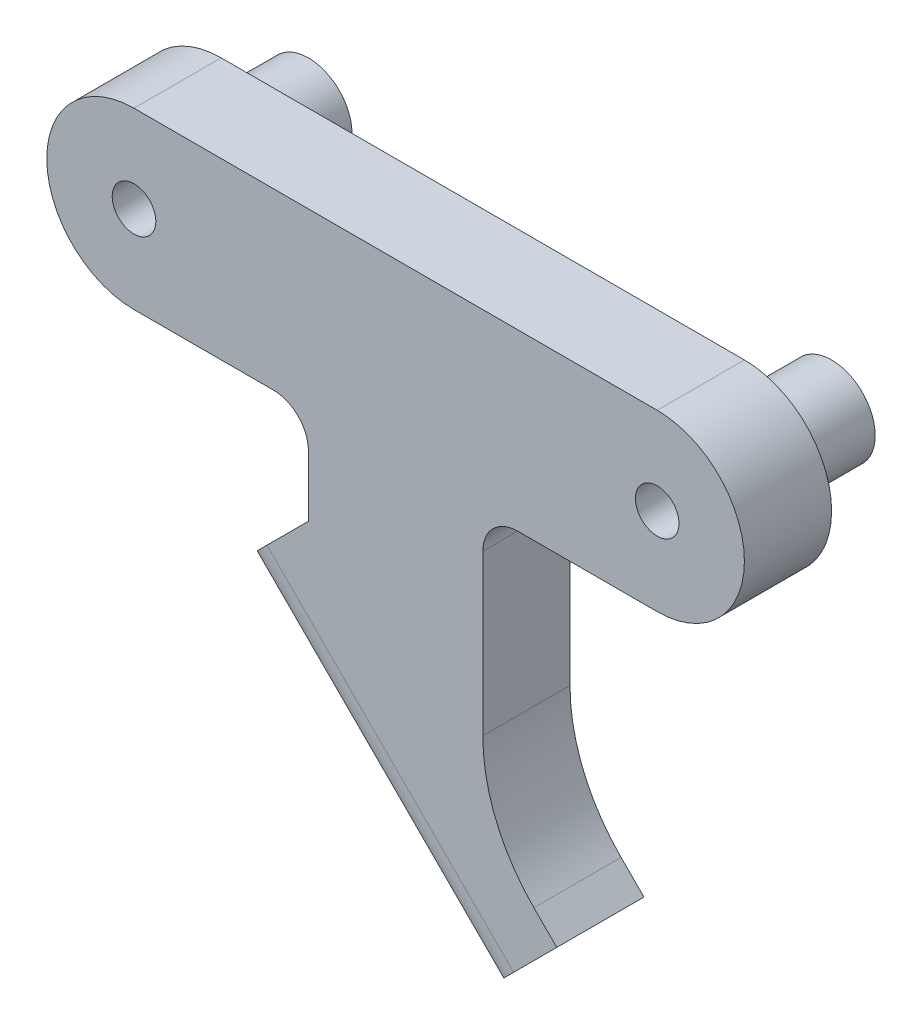
ISO-10303-21;
HEADER;
FILE_DESCRIPTION(('STEP AP214'),'2;1');
FILE_NAME('part.step','',(''),(''),'','','');
FILE_SCHEMA(('AUTOMOTIVE_DESIGN { 1 0 10303 214 1 1 1 1 }'));
ENDSEC;
DATA;
#1=APPLICATION_CONTEXT('core data for automotive mechanical design processes');
#2=APPLICATION_PROTOCOL_DEFINITION('international standard','automotive_design',2000,#1);
#3=PRODUCT_CONTEXT('',#1,'mechanical');
#4=PRODUCT('Part','Part','',(#3));
#5=PRODUCT_RELATED_PRODUCT_CATEGORY('part','',(#4));
#6=PRODUCT_DEFINITION_FORMATION('','',#4);
#7=PRODUCT_DEFINITION_CONTEXT('part definition',#1,'design');
#8=PRODUCT_DEFINITION('design','',#6,#7);
#9=PRODUCT_DEFINITION_SHAPE('','',#8);
#10=(LENGTH_UNIT() NAMED_UNIT(*) SI_UNIT(.MILLI.,.METRE.));
#11=(NAMED_UNIT(*) PLANE_ANGLE_UNIT() SI_UNIT($,.RADIAN.));
#12=(NAMED_UNIT(*) SI_UNIT($,.STERADIAN.) SOLID_ANGLE_UNIT());
#13=UNCERTAINTY_MEASURE_WITH_UNIT(LENGTH_MEASURE(1.E-05),#10,'distance_accuracy_value','');
#14=(GEOMETRIC_REPRESENTATION_CONTEXT(3) GLOBAL_UNCERTAINTY_ASSIGNED_CONTEXT((#13)) GLOBAL_UNIT_ASSIGNED_CONTEXT((#10,
#11,#12)) REPRESENTATION_CONTEXT('',''));
#15=CARTESIAN_POINT('',(0.,0.,0.));
#16=DIRECTION('',(0.,0.,1.));
#17=DIRECTION('',(1.,0.,0.));
#18=AXIS2_PLACEMENT_3D('',#15,#16,#17);
#19=CARTESIAN_POINT('',(-3.20799180327869,-5.,5.));
#20=DIRECTION('',(1.,0.,0.));
#21=DIRECTION('',(0.,1.,0.));
#22=AXIS2_PLACEMENT_3D('',#19,#20,#21);
#23=PLANE('',#22);
#24=DIRECTION('',(0.,-1.,0.));
#25=VECTOR('',#24,1.);
#26=CARTESIAN_POINT('',(-3.20799180327869,-5.,5.));
#27=LINE('',#26,#25);
#28=CARTESIAN_POINT('',(-3.20799180327869,-7.,5.));
#29=VERTEX_POINT('',#28);
#30=CARTESIAN_POINT('',(-3.20799180327869,-10.5098308312046,5.));
#31=VERTEX_POINT('',#30);
#32=EDGE_CURVE('E198',#29,#31,#27,.T.);
#33=ORIENTED_EDGE('',*,*,#32,.F.);
#34=DIRECTION('',(0.,0.,-1.));
#35=VECTOR('',#34,1.);
#36=CARTESIAN_POINT('',(-3.20799180327869,-7.,0.));
#37=LINE('',#36,#35);
#38=CARTESIAN_POINT('',(-3.20799180327869,-7.,0.));
#39=VERTEX_POINT('',#38);
#40=EDGE_CURVE('E253',#29,#39,#37,.T.);
#41=ORIENTED_EDGE('',*,*,#40,.T.);
#42=DIRECTION('',(0.,-1.,0.));
#43=VECTOR('',#42,1.);
#44=CARTESIAN_POINT('',(-3.20799180327869,-5.,0.));
#45=LINE('',#44,#43);
#46=CARTESIAN_POINT('',(-3.20799180327869,-10.5098308312046,0.));
#47=VERTEX_POINT('',#46);
#48=EDGE_CURVE('E215',#39,#47,#45,.T.);
#49=ORIENTED_EDGE('',*,*,#48,.T.);
#50=DIRECTION('',(0.,0.,-1.));
#51=VECTOR('',#50,1.);
#52=CARTESIAN_POINT('',(-3.20799180327869,-10.5098308312046,5.));
#53=LINE('',#52,#51);
#54=EDGE_CURVE('E159',#31,#47,#53,.T.);
#55=ORIENTED_EDGE('',*,*,#54,.F.);
#56=EDGE_LOOP('',(#33,#41,#49,#55));
#57=FACE_BOUND('',#56,.T.);
#58=ADVANCED_FACE('F48',(#57),#23,.F.);
#59=CARTESIAN_POINT('',(6.79200819672131,-5.,5.));
#60=DIRECTION('',(1.,0.,0.));
#61=DIRECTION('',(0.,1.,0.));
#62=AXIS2_PLACEMENT_3D('',#59,#60,#61);
#63=PLANE('',#62);
#64=DIRECTION('',(0.,1.,0.));
#65=VECTOR('',#64,1.);
#66=CARTESIAN_POINT('',(6.79200819672131,-28.7941020786666,5.));
#67=LINE('',#66,#65);
#68=CARTESIAN_POINT('',(6.79200819672131,-16.1666850806971,5.));
#69=VERTEX_POINT('',#68);
#70=CARTESIAN_POINT('',(6.79200819672131,-7.,5.));
#71=VERTEX_POINT('',#70);
#72=EDGE_CURVE('E200',#69,#71,#67,.T.);
#73=ORIENTED_EDGE('',*,*,#72,.F.);
#74=DIRECTION('',(0.,0.,-1.));
#75=VECTOR('',#74,1.);
#76=CARTESIAN_POINT('',(6.79200819672131,-16.1666850806971,5.));
#77=LINE('',#76,#75);
#78=CARTESIAN_POINT('',(6.79200819672131,-16.1666850806971,0.));
#79=VERTEX_POINT('',#78);
#80=EDGE_CURVE('E277',#69,#79,#77,.T.);
#81=ORIENTED_EDGE('',*,*,#80,.T.);
#82=DIRECTION('',(0.,-1.,0.));
#83=VECTOR('',#82,1.);
#84=CARTESIAN_POINT('',(6.79200819672131,-5.,0.));
#85=LINE('',#84,#83);
#86=CARTESIAN_POINT('',(6.79200819672131,-7.,0.));
#87=VERTEX_POINT('',#86);
#88=EDGE_CURVE('E217',#87,#79,#85,.T.);
#89=ORIENTED_EDGE('',*,*,#88,.F.);
#90=DIRECTION('',(0.,0.,-1.));
#91=VECTOR('',#90,1.);
#92=CARTESIAN_POINT('',(6.79200819672131,-7.,5.));
#93=LINE('',#92,#91);
#94=EDGE_CURVE('E266',#87,#71,#93,.F.);
#95=ORIENTED_EDGE('',*,*,#94,.T.);
#96=EDGE_LOOP('',(#73,#81,#89,#95));
#97=FACE_BOUND('',#96,.T.);
#98=ADVANCED_FACE('F284',(#97),#63,.T.);
#99=CARTESIAN_POINT('',(-13.2079918032787,0.,5.));
#100=DIRECTION('',(0.,0.,-1.));
#101=DIRECTION('',(-1.,0.,0.));
#102=AXIS2_PLACEMENT_3D('',#99,#100,#101);
#103=CYLINDRICAL_SURFACE('',#102,5.);
#104=CARTESIAN_POINT('',(-13.2079918032787,0.,0.));
#105=DIRECTION('',(0.,0.,1.));
#106=DIRECTION('',(1.,0.,0.));
#107=AXIS2_PLACEMENT_3D('',#104,#105,#106);
#108=CIRCLE('',#107,5.);
#109=CARTESIAN_POINT('',(-13.2079918032787,5.,0.));
#110=VERTEX_POINT('',#109);
#111=CARTESIAN_POINT('',(-13.2079918032787,-5.,0.));
#112=VERTEX_POINT('',#111);
#113=EDGE_CURVE('E190',#110,#112,#108,.T.);
#114=ORIENTED_EDGE('',*,*,#113,.T.);
#115=DIRECTION('',(0.,0.,-1.));
#116=VECTOR('',#115,1.);
#117=CARTESIAN_POINT('',(-13.2079918032787,-5.,5.));
#118=LINE('',#117,#116);
#119=CARTESIAN_POINT('',(-13.2079918032787,-5.,5.));
#120=VERTEX_POINT('',#119);
#121=EDGE_CURVE('E232',#120,#112,#118,.T.);
#122=ORIENTED_EDGE('',*,*,#121,.F.);
#123=CARTESIAN_POINT('',(-13.2079918032787,0.,5.));
#124=DIRECTION('',(0.,0.,1.));
#125=DIRECTION('',(1.,0.,0.));
#126=AXIS2_PLACEMENT_3D('',#123,#124,#125);
#127=CIRCLE('',#126,5.);
#128=CARTESIAN_POINT('',(-13.2079918032787,5.,5.));
#129=VERTEX_POINT('',#128);
#130=EDGE_CURVE('E191',#129,#120,#127,.T.);
#131=ORIENTED_EDGE('',*,*,#130,.F.);
#132=DIRECTION('',(0.,0.,-1.));
#133=VECTOR('',#132,1.);
#134=CARTESIAN_POINT('',(-13.2079918032787,5.,5.));
#135=LINE('',#134,#133);
#136=EDGE_CURVE('E209',#129,#110,#135,.T.);
#137=ORIENTED_EDGE('',*,*,#136,.T.);
#138=EDGE_LOOP('',(#114,#122,#131,#137));
#139=FACE_BOUND('',#138,.T.);
#140=ADVANCED_FACE('F313',(#139),#103,.T.);
#141=CARTESIAN_POINT('',(-13.2079918032787,-5.,5.));
#142=DIRECTION('',(0.,1.,0.));
#143=DIRECTION('',(0.,0.,1.));
#144=AXIS2_PLACEMENT_3D('',#141,#142,#143);
#145=PLANE('',#144);
#146=DIRECTION('',(1.,0.,0.));
#147=VECTOR('',#146,1.);
#148=CARTESIAN_POINT('',(-13.2079918032787,-5.,0.));
#149=LINE('',#148,#147);
#150=CARTESIAN_POINT('',(-5.20799180327869,-5.,0.));
#151=VERTEX_POINT('',#150);
#152=EDGE_CURVE('E212',#112,#151,#149,.T.);
#153=ORIENTED_EDGE('',*,*,#152,.T.);
#154=DIRECTION('',(0.,0.,-1.));
#155=VECTOR('',#154,1.);
#156=CARTESIAN_POINT('',(-5.20799180327869,-5.,5.));
#157=LINE('',#156,#155);
#158=CARTESIAN_POINT('',(-5.20799180327869,-5.,5.));
#159=VERTEX_POINT('',#158);
#160=EDGE_CURVE('E261',#151,#159,#157,.F.);
#161=ORIENTED_EDGE('',*,*,#160,.T.);
#162=DIRECTION('',(1.,0.,0.));
#163=VECTOR('',#162,1.);
#164=CARTESIAN_POINT('',(-13.2079918032787,-5.,5.));
#165=LINE('',#164,#163);
#166=EDGE_CURVE('E194',#120,#159,#165,.T.);
#167=ORIENTED_EDGE('',*,*,#166,.F.);
#168=ORIENTED_EDGE('',*,*,#121,.T.);
#169=EDGE_LOOP('',(#153,#161,#167,#168));
#170=FACE_BOUND('',#169,.T.);
#171=ADVANCED_FACE('F318',(#170),#145,.F.);
#172=CARTESIAN_POINT('',(6.79200819672131,-5.,5.));
#173=DIRECTION('',(0.,1.,0.));
#174=DIRECTION('',(-1.,0.,0.));
#175=AXIS2_PLACEMENT_3D('',#172,#173,#174);
#176=PLANE('',#175);
#177=DIRECTION('',(1.,0.,0.));
#178=VECTOR('',#177,1.);
#179=CARTESIAN_POINT('',(6.79200819672131,-5.,5.));
#180=LINE('',#179,#178);
#181=CARTESIAN_POINT('',(8.79200819672131,-5.,5.));
#182=VERTEX_POINT('',#181);
#183=CARTESIAN_POINT('',(16.7920081967213,-5.,5.));
#184=VERTEX_POINT('',#183);
#185=EDGE_CURVE('E202',#182,#184,#180,.T.);
#186=ORIENTED_EDGE('',*,*,#185,.F.);
#187=DIRECTION('',(0.,0.,-1.));
#188=VECTOR('',#187,1.);
#189=CARTESIAN_POINT('',(8.79200819672131,-5.,5.));
#190=LINE('',#189,#188);
#191=CARTESIAN_POINT('',(8.79200819672131,-5.,0.));
#192=VERTEX_POINT('',#191);
#193=EDGE_CURVE('E263',#182,#192,#190,.T.);
#194=ORIENTED_EDGE('',*,*,#193,.T.);
#195=DIRECTION('',(1.,0.,0.));
#196=VECTOR('',#195,1.);
#197=CARTESIAN_POINT('',(6.79200819672131,-5.,0.));
#198=LINE('',#197,#196);
#199=CARTESIAN_POINT('',(16.7920081967213,-5.,0.));
#200=VERTEX_POINT('',#199);
#201=EDGE_CURVE('E219',#192,#200,#198,.T.);
#202=ORIENTED_EDGE('',*,*,#201,.T.);
#203=DIRECTION('',(0.,0.,-1.));
#204=VECTOR('',#203,1.);
#205=CARTESIAN_POINT('',(16.7920081967213,-5.,5.));
#206=LINE('',#205,#204);
#207=EDGE_CURVE('E229',#184,#200,#206,.T.);
#208=ORIENTED_EDGE('',*,*,#207,.F.);
#209=EDGE_LOOP('',(#186,#194,#202,#208));
#210=FACE_BOUND('',#209,.T.);
#211=ADVANCED_FACE('F297',(#210),#176,.F.);
#212=CARTESIAN_POINT('',(16.7920081967213,0.,5.));
#213=DIRECTION('',(0.,0.,-1.));
#214=DIRECTION('',(-1.,0.,0.));
#215=AXIS2_PLACEMENT_3D('',#212,#213,#214);
#216=CYLINDRICAL_SURFACE('',#215,5.);
#217=CARTESIAN_POINT('',(16.7920081967213,0.,0.));
#218=DIRECTION('',(0.,0.,1.));
#219=DIRECTION('',(1.,0.,0.));
#220=AXIS2_PLACEMENT_3D('',#217,#218,#219);
#221=CIRCLE('',#220,5.);
#222=CARTESIAN_POINT('',(16.7920081967213,5.,0.));
#223=VERTEX_POINT('',#222);
#224=EDGE_CURVE('E221',#200,#223,#221,.T.);
#225=ORIENTED_EDGE('',*,*,#224,.T.);
#226=DIRECTION('',(0.,0.,-1.));
#227=VECTOR('',#226,1.);
#228=CARTESIAN_POINT('',(16.7920081967213,5.,5.));
#229=LINE('',#228,#227);
#230=CARTESIAN_POINT('',(16.7920081967213,5.,5.));
#231=VERTEX_POINT('',#230);
#232=EDGE_CURVE('E227',#231,#223,#229,.T.);
#233=ORIENTED_EDGE('',*,*,#232,.F.);
#234=CARTESIAN_POINT('',(16.7920081967213,0.,5.));
#235=DIRECTION('',(0.,0.,1.));
#236=DIRECTION('',(1.,0.,0.));
#237=AXIS2_PLACEMENT_3D('',#234,#235,#236);
#238=CIRCLE('',#237,5.);
#239=EDGE_CURVE('E204',#184,#231,#238,.T.);
#240=ORIENTED_EDGE('',*,*,#239,.F.);
#241=ORIENTED_EDGE('',*,*,#207,.T.);
#242=EDGE_LOOP('',(#225,#233,#240,#241));
#243=FACE_BOUND('',#242,.T.);
#244=ADVANCED_FACE('F415',(#243),#216,.T.);
#245=CARTESIAN_POINT('',(-13.2079918032787,5.,5.));
#246=DIRECTION('',(0.,1.,0.));
#247=DIRECTION('',(0.,0.,1.));
#248=AXIS2_PLACEMENT_3D('',#245,#246,#247);
#249=PLANE('',#248);
#250=DIRECTION('',(1.,0.,0.));
#251=VECTOR('',#250,1.);
#252=CARTESIAN_POINT('',(-13.2079918032787,5.,0.));
#253=LINE('',#252,#251);
#254=EDGE_CURVE('E195',#110,#223,#253,.T.);
#255=ORIENTED_EDGE('',*,*,#254,.F.);
#256=ORIENTED_EDGE('',*,*,#136,.F.);
#257=DIRECTION('',(1.,0.,0.));
#258=VECTOR('',#257,1.);
#259=CARTESIAN_POINT('',(-13.2079918032787,5.,5.));
#260=LINE('',#259,#258);
#261=EDGE_CURVE('E206',#129,#231,#260,.T.);
#262=ORIENTED_EDGE('',*,*,#261,.T.);
#263=ORIENTED_EDGE('',*,*,#232,.T.);
#264=EDGE_LOOP('',(#255,#256,#262,#263));
#265=FACE_BOUND('',#264,.T.);
#266=ADVANCED_FACE('F411',(#265),#249,.T.);
#267=CARTESIAN_POINT('',(-13.2079918032787,0.,5.));
#268=DIRECTION('',(0.,0.,1.));
#269=DIRECTION('',(1.,0.,0.));
#270=AXIS2_PLACEMENT_3D('',#267,#268,#269);
#271=PLANE('',#270);
#272=CARTESIAN_POINT('',(16.7920081967213,0.,5.));
#273=DIRECTION('',(0.,0.,-1.));
#274=DIRECTION('',(-1.,0.,0.));
#275=AXIS2_PLACEMENT_3D('',#272,#273,#274);
#276=CIRCLE('',#275,1.25);
#277=CARTESIAN_POINT('',(15.5420081967213,0.,5.));
#278=VERTEX_POINT('',#277);
#279=EDGE_CURVE('E258',#278,#278,#276,.T.);
#280=ORIENTED_EDGE('',*,*,#279,.T.);
#281=EDGE_LOOP('',(#280));
#282=FACE_BOUND('',#281,.T.);
#283=CARTESIAN_POINT('',(-13.2079918032787,0.,5.));
#284=DIRECTION('',(0.,0.,-1.));
#285=DIRECTION('',(-1.,0.,0.));
#286=AXIS2_PLACEMENT_3D('',#283,#284,#285);
#287=CIRCLE('',#286,1.25);
#288=CARTESIAN_POINT('',(-14.4579918032787,0.,5.));
#289=VERTEX_POINT('',#288);
#290=EDGE_CURVE('E368',#289,#289,#287,.T.);
#291=ORIENTED_EDGE('',*,*,#290,.T.);
#292=EDGE_LOOP('',(#291));
#293=FACE_BOUND('',#292,.T.);
#294=DIRECTION('',(0.707106781186539,0.707106781186556,0.));
#295=VECTOR('',#294,1.);
#296=CARTESIAN_POINT('',(-7.35012742700981,-14.6519664549358,5.));
#297=LINE('',#296,#295);
#298=CARTESIAN_POINT('',(-5.58236047404346,-12.8841995019694,5.));
#299=VERTEX_POINT('',#298);
#300=EDGE_CURVE('E177',#299,#31,#297,.T.);
#301=ORIENTED_EDGE('',*,*,#300,.F.);
#302=DIRECTION('',(0.707106781186556,-0.707106781186539,0.));
#303=VECTOR('',#302,1.);
#304=CARTESIAN_POINT('',(8.55977514968766,-27.0263351257002,5.));
#305=LINE('',#304,#303);
#306=CARTESIAN_POINT('',(8.55977514968767,-27.0263351257002,5.));
#307=VERTEX_POINT('',#306);
#308=EDGE_CURVE('E167',#299,#307,#305,.T.);
#309=ORIENTED_EDGE('',*,*,#308,.T.);
#310=DIRECTION('',(0.707106781186539,0.707106781186556,0.));
#311=VECTOR('',#310,1.);
#312=CARTESIAN_POINT('',(6.79200819672131,-28.7941020786666,5.));
#313=LINE('',#312,#311);
#314=CARTESIAN_POINT('',(11.0346488838405,-24.5514613915472,5.));
#315=VERTEX_POINT('',#314);
#316=EDGE_CURVE('E163',#307,#315,#313,.T.);
#317=ORIENTED_EDGE('',*,*,#316,.T.);
#318=DIRECTION('',(0.707106781186556,-0.707106781186539,0.));
#319=VECTOR('',#318,1.);
#320=CARTESIAN_POINT('',(-3.10748673989058,-10.4093257678165,5.));
#321=LINE('',#320,#319);
#322=CARTESIAN_POINT('',(9.72094038485592,-23.2377528925627,5.));
#323=VERTEX_POINT('',#322);
#324=EDGE_CURVE('E151',#323,#315,#321,.T.);
#325=ORIENTED_EDGE('',*,*,#324,.F.);
#326=CARTESIAN_POINT('',(16.7920081967213,-16.1666850806971,5.));
#327=DIRECTION('',(0.,0.,1.));
#328=DIRECTION('',(1.,0.,0.));
#329=AXIS2_PLACEMENT_3D('',#326,#327,#328);
#330=CIRCLE('',#329,10.);
#331=EDGE_CURVE('E13',#323,#69,#330,.F.);
#332=ORIENTED_EDGE('',*,*,#331,.T.);
#333=ORIENTED_EDGE('',*,*,#72,.T.);
#334=CARTESIAN_POINT('',(8.79200819672131,-7.,5.));
#335=DIRECTION('',(0.,0.,1.));
#336=DIRECTION('',(1.,0.,0.));
#337=AXIS2_PLACEMENT_3D('',#334,#335,#336);
#338=CIRCLE('',#337,2.);
#339=EDGE_CURVE('E275',#71,#182,#338,.F.);
#340=ORIENTED_EDGE('',*,*,#339,.T.);
#341=ORIENTED_EDGE('',*,*,#185,.T.);
#342=ORIENTED_EDGE('',*,*,#239,.T.);
#343=ORIENTED_EDGE('',*,*,#261,.F.);
#344=ORIENTED_EDGE('',*,*,#130,.T.);
#345=ORIENTED_EDGE('',*,*,#166,.T.);
#346=CARTESIAN_POINT('',(-5.20799180327869,-7.,5.));
#347=DIRECTION('',(0.,0.,1.));
#348=DIRECTION('',(1.,0.,0.));
#349=AXIS2_PLACEMENT_3D('',#346,#347,#348);
#350=CIRCLE('',#349,2.);
#351=EDGE_CURVE('E271',#159,#29,#350,.F.);
#352=ORIENTED_EDGE('',*,*,#351,.T.);
#353=ORIENTED_EDGE('',*,*,#32,.T.);
#354=EDGE_LOOP('',(#301,#309,#317,#325,#332,#333,#340,#341,#342,#343,#344,#345,#352,#353));
#355=FACE_BOUND('',#354,.T.);
#356=ADVANCED_FACE('F165',(#282,#293,#355),#271,.T.);
#357=CARTESIAN_POINT('',(-13.2079918032787,0.,0.));
#358=DIRECTION('',(0.,0.,1.));
#359=DIRECTION('',(1.,0.,0.));
#360=AXIS2_PLACEMENT_3D('',#357,#358,#359);
#361=PLANE('',#360);
#362=DIRECTION('',(-0.707106781186539,-0.707106781186556,0.));
#363=VECTOR('',#362,1.);
#364=CARTESIAN_POINT('',(6.79200819672131,-28.7941020786666,0.));
#365=LINE('',#364,#363);
#366=CARTESIAN_POINT('',(11.0346488838405,-24.5514613915472,0.));
#367=VERTEX_POINT('',#366);
#368=CARTESIAN_POINT('',(8.55977514968767,-27.0263351257002,0.));
#369=VERTEX_POINT('',#368);
#370=EDGE_CURVE('E170',#367,#369,#365,.T.);
#371=ORIENTED_EDGE('',*,*,#370,.T.);
#372=DIRECTION('',(0.707106781186556,-0.707106781186539,0.));
#373=VECTOR('',#372,1.);
#374=CARTESIAN_POINT('',(-15.8372758896459,-2.62928408636725,0.));
#375=LINE('',#374,#373);
#376=CARTESIAN_POINT('',(-5.58236047404346,-12.8841995019694,0.));
#377=VERTEX_POINT('',#376);
#378=EDGE_CURVE('E245',#369,#377,#375,.F.);
#379=ORIENTED_EDGE('',*,*,#378,.T.);
#380=DIRECTION('',(-0.707106781186539,-0.707106781186556,0.));
#381=VECTOR('',#380,1.);
#382=CARTESIAN_POINT('',(-7.35012742700981,-14.6519664549358,0.));
#383=LINE('',#382,#381);
#384=EDGE_CURVE('E174',#47,#377,#383,.T.);
#385=ORIENTED_EDGE('',*,*,#384,.F.);
#386=ORIENTED_EDGE('',*,*,#48,.F.);
#387=CARTESIAN_POINT('',(-5.20799180327869,-7.,0.));
#388=DIRECTION('',(0.,0.,1.));
#389=DIRECTION('',(1.,0.,0.));
#390=AXIS2_PLACEMENT_3D('',#387,#388,#389);
#391=CIRCLE('',#390,2.);
#392=EDGE_CURVE('E269',#39,#151,#391,.T.);
#393=ORIENTED_EDGE('',*,*,#392,.T.);
#394=ORIENTED_EDGE('',*,*,#152,.F.);
#395=ORIENTED_EDGE('',*,*,#113,.F.);
#396=ORIENTED_EDGE('',*,*,#254,.T.);
#397=ORIENTED_EDGE('',*,*,#224,.F.);
#398=ORIENTED_EDGE('',*,*,#201,.F.);
#399=CARTESIAN_POINT('',(8.79200819672131,-7.,0.));
#400=DIRECTION('',(0.,0.,1.));
#401=DIRECTION('',(1.,0.,0.));
#402=AXIS2_PLACEMENT_3D('',#399,#400,#401);
#403=CIRCLE('',#402,2.);
#404=EDGE_CURVE('E273',#192,#87,#403,.T.);
#405=ORIENTED_EDGE('',*,*,#404,.T.);
#406=ORIENTED_EDGE('',*,*,#88,.T.);
#407=CARTESIAN_POINT('',(16.7920081967213,-16.1666850806971,0.));
#408=DIRECTION('',(0.,0.,1.));
#409=DIRECTION('',(1.,0.,0.));
#410=AXIS2_PLACEMENT_3D('',#407,#408,#409);
#411=CIRCLE('',#410,10.);
#412=CARTESIAN_POINT('',(9.72094038485592,-23.2377528925627,0.));
#413=VERTEX_POINT('',#412);
#414=EDGE_CURVE('E56',#79,#413,#411,.T.);
#415=ORIENTED_EDGE('',*,*,#414,.T.);
#416=DIRECTION('',(0.707106781186556,-0.707106781186539,0.));
#417=VECTOR('',#416,1.);
#418=CARTESIAN_POINT('',(-3.10748673989058,-10.4093257678165,0.));
#419=LINE('',#418,#417);
#420=EDGE_CURVE('E160',#413,#367,#419,.T.);
#421=ORIENTED_EDGE('',*,*,#420,.T.);
#422=EDGE_LOOP('',(#371,#379,#385,#386,#393,#394,#395,#396,#397,#398,#405,#406,#415,#421));
#423=FACE_BOUND('',#422,.T.);
#424=CARTESIAN_POINT('',(16.7920081967213,0.,0.));
#425=DIRECTION('',(0.,0.,1.));
#426=DIRECTION('',(1.,0.,0.));
#427=AXIS2_PLACEMENT_3D('',#424,#425,#426);
#428=CIRCLE('',#427,2.5);
#429=CARTESIAN_POINT('',(19.2920081967213,0.,0.));
#430=VERTEX_POINT('',#429);
#431=EDGE_CURVE('E235',#430,#430,#428,.F.);
#432=ORIENTED_EDGE('',*,*,#431,.F.);
#433=EDGE_LOOP('',(#432));
#434=FACE_BOUND('',#433,.T.);
#435=CARTESIAN_POINT('',(-13.2079918032787,0.,0.));
#436=DIRECTION('',(0.,0.,1.));
#437=DIRECTION('',(1.,0.,0.));
#438=AXIS2_PLACEMENT_3D('',#435,#436,#437);
#439=CIRCLE('',#438,2.5);
#440=CARTESIAN_POINT('',(-10.7079918032787,0.,0.));
#441=VERTEX_POINT('',#440);
#442=EDGE_CURVE('E238',#441,#441,#439,.F.);
#443=ORIENTED_EDGE('',*,*,#442,.F.);
#444=EDGE_LOOP('',(#443));
#445=FACE_BOUND('',#444,.T.);
#446=ADVANCED_FACE('F287',(#423,#434,#445),#361,.F.);
#447=CARTESIAN_POINT('',(16.7920081967213,0.,-5.));
#448=DIRECTION('',(0.,0.,1.));
#449=DIRECTION('',(1.,0.,0.));
#450=AXIS2_PLACEMENT_3D('',#447,#448,#449);
#451=CYLINDRICAL_SURFACE('',#450,2.5);
#452=CARTESIAN_POINT('',(16.7920081967213,0.,-5.));
#453=DIRECTION('',(0.,0.,-1.));
#454=DIRECTION('',(-1.,0.,0.));
#455=AXIS2_PLACEMENT_3D('',#452,#453,#454);
#456=CIRCLE('',#455,2.5);
#457=CARTESIAN_POINT('',(14.2920081967213,0.,-5.));
#458=VERTEX_POINT('',#457);
#459=EDGE_CURVE('E187',#458,#458,#456,.T.);
#460=ORIENTED_EDGE('',*,*,#459,.F.);
#461=EDGE_LOOP('',(#460));
#462=FACE_BOUND('',#461,.T.);
#463=ORIENTED_EDGE('',*,*,#431,.T.);
#464=EDGE_LOOP('',(#463));
#465=FACE_BOUND('',#464,.T.);
#466=ADVANCED_FACE('F385',(#462,#465),#451,.T.);
#467=CARTESIAN_POINT('',(16.7920081967213,0.,-5.));
#468=DIRECTION('',(0.,0.,-1.));
#469=DIRECTION('',(-1.,0.,0.));
#470=AXIS2_PLACEMENT_3D('',#467,#468,#469);
#471=PLANE('',#470);
#472=CARTESIAN_POINT('',(16.7920081967213,0.,-5.));
#473=DIRECTION('',(0.,0.,-1.));
#474=DIRECTION('',(-1.,0.,0.));
#475=AXIS2_PLACEMENT_3D('',#472,#473,#474);
#476=CIRCLE('',#475,1.25);
#477=CARTESIAN_POINT('',(15.5420081967213,0.,-5.));
#478=VERTEX_POINT('',#477);
#479=EDGE_CURVE('E371',#478,#478,#476,.T.);
#480=ORIENTED_EDGE('',*,*,#479,.F.);
#481=EDGE_LOOP('',(#480));
#482=FACE_BOUND('',#481,.T.);
#483=ORIENTED_EDGE('',*,*,#459,.T.);
#484=EDGE_LOOP('',(#483));
#485=FACE_BOUND('',#484,.T.);
#486=ADVANCED_FACE('F381',(#482,#485),#471,.T.);
#487=CARTESIAN_POINT('',(-13.2079918032787,0.,-5.));
#488=DIRECTION('',(0.,0.,1.));
#489=DIRECTION('',(1.,0.,0.));
#490=AXIS2_PLACEMENT_3D('',#487,#488,#489);
#491=CYLINDRICAL_SURFACE('',#490,2.5);
#492=CARTESIAN_POINT('',(-13.2079918032787,0.,-5.));
#493=DIRECTION('',(0.,0.,-1.));
#494=DIRECTION('',(-1.,0.,0.));
#495=AXIS2_PLACEMENT_3D('',#492,#493,#494);
#496=CIRCLE('',#495,2.5);
#497=CARTESIAN_POINT('',(-15.7079918032787,0.,-5.));
#498=VERTEX_POINT('',#497);
#499=EDGE_CURVE('E184',#498,#498,#496,.T.);
#500=ORIENTED_EDGE('',*,*,#499,.F.);
#501=EDGE_LOOP('',(#500));
#502=FACE_BOUND('',#501,.T.);
#503=ORIENTED_EDGE('',*,*,#442,.T.);
#504=EDGE_LOOP('',(#503));
#505=FACE_BOUND('',#504,.T.);
#506=ADVANCED_FACE('F384',(#502,#505),#491,.T.);
#507=CARTESIAN_POINT('',(-13.2079918032787,0.,-5.));
#508=DIRECTION('',(0.,0.,-1.));
#509=DIRECTION('',(-1.,0.,0.));
#510=AXIS2_PLACEMENT_3D('',#507,#508,#509);
#511=PLANE('',#510);
#512=CARTESIAN_POINT('',(-13.2079918032787,0.,-5.));
#513=DIRECTION('',(0.,0.,-1.));
#514=DIRECTION('',(-1.,0.,0.));
#515=AXIS2_PLACEMENT_3D('',#512,#513,#514);
#516=CIRCLE('',#515,1.25);
#517=CARTESIAN_POINT('',(-14.4579918032787,0.,-5.));
#518=VERTEX_POINT('',#517);
#519=EDGE_CURVE('E365',#518,#518,#516,.T.);
#520=ORIENTED_EDGE('',*,*,#519,.F.);
#521=EDGE_LOOP('',(#520));
#522=FACE_BOUND('',#521,.T.);
#523=ORIENTED_EDGE('',*,*,#499,.T.);
#524=EDGE_LOOP('',(#523));
#525=FACE_BOUND('',#524,.T.);
#526=ADVANCED_FACE('F399',(#522,#525),#511,.T.);
#527=CARTESIAN_POINT('',(17.793055137694,-17.7930551376936,0.));
#528=DIRECTION('',(0.707106781186556,-0.707106781186539,0.));
#529=DIRECTION('',(0.707106781186539,0.707106781186556,0.));
#530=AXIS2_PLACEMENT_3D('',#527,#528,#529);
#531=PLANE('',#530);
#532=CARTESIAN_POINT('',(8.91332854028093,-26.6727817351069,2.5));
#533=DIRECTION('',(-0.707106781186556,0.707106781186539,0.));
#534=DIRECTION('',(-0.707106781186539,-0.707106781186556,0.));
#535=AXIS2_PLACEMENT_3D('',#532,#533,#534);
#536=CIRCLE('',#535,1.65);
#537=CARTESIAN_POINT('',(7.74660235132314,-27.8395079240647,2.5));
#538=VERTEX_POINT('',#537);
#539=EDGE_CURVE('E257',#538,#538,#536,.T.);
#540=ORIENTED_EDGE('',*,*,#539,.T.);
#541=EDGE_LOOP('',(#540));
#542=FACE_BOUND('',#541,.T.);
#543=CARTESIAN_POINT('',(8.55977514968767,-27.0263351257002,2.5));
#544=DIRECTION('',(0.707106781186556,-0.707106781186539,0.));
#545=DIRECTION('',(0.707106781186539,0.707106781186556,0.));
#546=AXIS2_PLACEMENT_3D('',#543,#544,#545);
#547=CIRCLE('',#546,2.5);
#548=CARTESIAN_POINT('',(6.79200819672131,-28.7941020786666,2.5));
#549=VERTEX_POINT('',#548);
#550=EDGE_CURVE('E241',#307,#549,#547,.T.);
#551=ORIENTED_EDGE('',*,*,#550,.T.);
#552=CARTESIAN_POINT('',(8.55977514968767,-27.0263351257002,2.5));
#553=DIRECTION('',(0.707106781186556,-0.707106781186539,0.));
#554=DIRECTION('',(0.707106781186539,0.707106781186556,0.));
#555=AXIS2_PLACEMENT_3D('',#552,#553,#554);
#556=CIRCLE('',#555,2.5);
#557=EDGE_CURVE('E243',#549,#369,#556,.T.);
#558=ORIENTED_EDGE('',*,*,#557,.T.);
#559=ORIENTED_EDGE('',*,*,#370,.F.);
#560=DIRECTION('',(0.,0.,-1.));
#561=VECTOR('',#560,1.);
#562=CARTESIAN_POINT('',(11.0346488838405,-24.5514613915472,0.));
#563=LINE('',#562,#561);
#564=EDGE_CURVE('E155',#315,#367,#563,.T.);
#565=ORIENTED_EDGE('',*,*,#564,.F.);
#566=ORIENTED_EDGE('',*,*,#316,.F.);
#567=EDGE_LOOP('',(#551,#558,#559,#565,#566));
#568=FACE_BOUND('',#567,.T.);
#569=ADVANCED_FACE('F172',(#542,#568),#531,.T.);
#570=CARTESIAN_POINT('',(-3.10748673989058,-10.4093257678165,0.));
#571=DIRECTION('',(-0.707106781186539,-0.707106781186556,0.));
#572=DIRECTION('',(0.707106781186556,-0.707106781186539,0.));
#573=AXIS2_PLACEMENT_3D('',#570,#571,#572);
#574=PLANE('',#573);
#575=ORIENTED_EDGE('',*,*,#420,.F.);
#576=DIRECTION('',(0.,0.,-1.));
#577=VECTOR('',#576,1.);
#578=CARTESIAN_POINT('',(9.72094038485592,-23.2377528925627,0.));
#579=LINE('',#578,#577);
#580=EDGE_CURVE('E69',#413,#323,#579,.F.);
#581=ORIENTED_EDGE('',*,*,#580,.T.);
#582=ORIENTED_EDGE('',*,*,#324,.T.);
#583=ORIENTED_EDGE('',*,*,#564,.T.);
#584=EDGE_LOOP('',(#575,#581,#582,#583));
#585=FACE_BOUND('',#584,.T.);
#586=ADVANCED_FACE('F153',(#585),#574,.F.);
#587=CARTESIAN_POINT('',(3.65091951396291,-3.65091951396282,0.));
#588=DIRECTION('',(0.707106781186556,-0.707106781186539,0.));
#589=DIRECTION('',(0.707106781186539,0.707106781186556,0.));
#590=AXIS2_PLACEMENT_3D('',#587,#588,#589);
#591=PLANE('',#590);
#592=CARTESIAN_POINT('',(-5.22880708345019,-12.5306461113761,2.5));
#593=DIRECTION('',(0.707106781186556,-0.707106781186539,0.));
#594=DIRECTION('',(0.707106781186539,0.707106781186556,0.));
#595=AXIS2_PLACEMENT_3D('',#592,#593,#594);
#596=CIRCLE('',#595,1.65);
#597=CARTESIAN_POINT('',(-4.0620808944924,-11.3639199224183,2.5));
#598=VERTEX_POINT('',#597);
#599=EDGE_CURVE('E358',#598,#598,#596,.T.);
#600=ORIENTED_EDGE('',*,*,#599,.T.);
#601=EDGE_LOOP('',(#600));
#602=FACE_BOUND('',#601,.T.);
#603=ORIENTED_EDGE('',*,*,#384,.T.);
#604=CARTESIAN_POINT('',(-5.58236047404346,-12.8841995019694,2.5));
#605=DIRECTION('',(0.707106781186556,-0.707106781186539,0.));
#606=DIRECTION('',(0.707106781186539,0.707106781186556,0.));
#607=AXIS2_PLACEMENT_3D('',#604,#605,#606);
#608=CIRCLE('',#607,2.5);
#609=CARTESIAN_POINT('',(-7.35012742700981,-14.6519664549358,2.5));
#610=VERTEX_POINT('',#609);
#611=EDGE_CURVE('E250',#377,#610,#608,.F.);
#612=ORIENTED_EDGE('',*,*,#611,.T.);
#613=CARTESIAN_POINT('',(-5.58236047404345,-12.8841995019694,2.5));
#614=DIRECTION('',(0.707106781186556,-0.707106781186539,0.));
#615=DIRECTION('',(0.707106781186539,0.707106781186556,0.));
#616=AXIS2_PLACEMENT_3D('',#613,#614,#615);
#617=CIRCLE('',#616,2.5);
#618=EDGE_CURVE('E248',#610,#299,#617,.F.);
#619=ORIENTED_EDGE('',*,*,#618,.T.);
#620=ORIENTED_EDGE('',*,*,#300,.T.);
#621=ORIENTED_EDGE('',*,*,#54,.T.);
#622=EDGE_LOOP('',(#603,#612,#619,#620,#621));
#623=FACE_BOUND('',#622,.T.);
#624=ADVANCED_FACE('F351',(#602,#623),#591,.F.);
#625=CARTESIAN_POINT('',(-8.52880708345023,-9.23064611137618,2.5));
#626=DIRECTION('',(0.707106781186556,-0.707106781186539,0.));
#627=DIRECTION('',(0.707106781186539,0.707106781186556,0.));
#628=AXIS2_PLACEMENT_3D('',#625,#626,#627);
#629=CYLINDRICAL_SURFACE('',#628,1.65);
#630=ORIENTED_EDGE('',*,*,#599,.F.);
#631=EDGE_LOOP('',(#630));
#632=FACE_BOUND('',#631,.T.);
#633=ORIENTED_EDGE('',*,*,#539,.F.);
#634=EDGE_LOOP('',(#633));
#635=FACE_BOUND('',#634,.T.);
#636=ADVANCED_FACE('F333',(#632,#635),#629,.F.);
#637=CARTESIAN_POINT('',(-15.8372758896459,-2.62928408636725,2.5));
#638=DIRECTION('',(-0.707106781186556,0.707106781186539,0.));
#639=DIRECTION('',(-0.707106781186539,-0.707106781186556,0.));
#640=AXIS2_PLACEMENT_3D('',#637,#638,#639);
#641=CYLINDRICAL_SURFACE('',#640,2.5);
#642=ORIENTED_EDGE('',*,*,#308,.F.);
#643=ORIENTED_EDGE('',*,*,#618,.F.);
#644=DIRECTION('',(0.707106781186556,-0.707106781186539,0.));
#645=VECTOR('',#644,1.);
#646=CARTESIAN_POINT('',(-7.35012742700981,-14.6519664549358,2.5));
#647=LINE('',#646,#645);
#648=EDGE_CURVE('E254',#549,#610,#647,.F.);
#649=ORIENTED_EDGE('',*,*,#648,.F.);
#650=ORIENTED_EDGE('',*,*,#550,.F.);
#651=EDGE_LOOP('',(#642,#643,#649,#650));
#652=FACE_BOUND('',#651,.T.);
#653=ADVANCED_FACE('F329',(#652),#641,.T.);
#654=CARTESIAN_POINT('',(-1.44022485031234,-17.0263351257004,2.5));
#655=DIRECTION('',(0.707106781186556,-0.707106781186539,0.));
#656=DIRECTION('',(0.707106781186539,0.707106781186556,0.));
#657=AXIS2_PLACEMENT_3D('',#654,#655,#656);
#658=CYLINDRICAL_SURFACE('',#657,2.5);
#659=ORIENTED_EDGE('',*,*,#611,.F.);
#660=ORIENTED_EDGE('',*,*,#378,.F.);
#661=ORIENTED_EDGE('',*,*,#557,.F.);
#662=ORIENTED_EDGE('',*,*,#648,.T.);
#663=EDGE_LOOP('',(#659,#660,#661,#662));
#664=FACE_BOUND('',#663,.T.);
#665=ADVANCED_FACE('F325',(#664),#658,.T.);
#666=CARTESIAN_POINT('',(-13.2079918032787,0.,5.));
#667=DIRECTION('',(0.,0.,-1.));
#668=DIRECTION('',(-1.,0.,0.));
#669=AXIS2_PLACEMENT_3D('',#666,#667,#668);
#670=CYLINDRICAL_SURFACE('',#669,1.25);
#671=ORIENTED_EDGE('',*,*,#290,.F.);
#672=EDGE_LOOP('',(#671));
#673=FACE_BOUND('',#672,.T.);
#674=ORIENTED_EDGE('',*,*,#519,.T.);
#675=EDGE_LOOP('',(#674));
#676=FACE_BOUND('',#675,.T.);
#677=ADVANCED_FACE('F328',(#673,#676),#670,.F.);
#678=CARTESIAN_POINT('',(16.7920081967213,0.,5.));
#679=DIRECTION('',(0.,0.,-1.));
#680=DIRECTION('',(-1.,0.,0.));
#681=AXIS2_PLACEMENT_3D('',#678,#679,#680);
#682=CYLINDRICAL_SURFACE('',#681,1.25);
#683=ORIENTED_EDGE('',*,*,#279,.F.);
#684=EDGE_LOOP('',(#683));
#685=FACE_BOUND('',#684,.T.);
#686=ORIENTED_EDGE('',*,*,#479,.T.);
#687=EDGE_LOOP('',(#686));
#688=FACE_BOUND('',#687,.T.);
#689=ADVANCED_FACE('F336',(#685,#688),#682,.F.);
#690=CARTESIAN_POINT('',(-5.20799180327869,-7.,5.));
#691=DIRECTION('',(0.,0.,1.));
#692=DIRECTION('',(1.,0.,0.));
#693=AXIS2_PLACEMENT_3D('',#690,#691,#692);
#694=CYLINDRICAL_SURFACE('',#693,2.);
#695=ORIENTED_EDGE('',*,*,#351,.F.);
#696=ORIENTED_EDGE('',*,*,#160,.F.);
#697=ORIENTED_EDGE('',*,*,#392,.F.);
#698=ORIENTED_EDGE('',*,*,#40,.F.);
#699=EDGE_LOOP('',(#695,#696,#697,#698));
#700=FACE_BOUND('',#699,.T.);
#701=ADVANCED_FACE('F306',(#700),#694,.F.);
#702=CARTESIAN_POINT('',(8.79200819672131,-7.,5.));
#703=DIRECTION('',(0.,0.,-1.));
#704=DIRECTION('',(-1.,0.,0.));
#705=AXIS2_PLACEMENT_3D('',#702,#703,#704);
#706=CYLINDRICAL_SURFACE('',#705,2.);
#707=ORIENTED_EDGE('',*,*,#339,.F.);
#708=ORIENTED_EDGE('',*,*,#94,.F.);
#709=ORIENTED_EDGE('',*,*,#404,.F.);
#710=ORIENTED_EDGE('',*,*,#193,.F.);
#711=EDGE_LOOP('',(#707,#708,#709,#710));
#712=FACE_BOUND('',#711,.T.);
#713=ADVANCED_FACE('F294',(#712),#706,.F.);
#714=CARTESIAN_POINT('',(16.7920081967213,-16.1666850806971,5.));
#715=DIRECTION('',(0.,0.,-1.));
#716=DIRECTION('',(-1.,0.,0.));
#717=AXIS2_PLACEMENT_3D('',#714,#715,#716);
#718=CYLINDRICAL_SURFACE('',#717,10.);
#719=ORIENTED_EDGE('',*,*,#331,.F.);
#720=ORIENTED_EDGE('',*,*,#580,.F.);
#721=ORIENTED_EDGE('',*,*,#414,.F.);
#722=ORIENTED_EDGE('',*,*,#80,.F.);
#723=EDGE_LOOP('',(#719,#720,#721,#722));
#724=FACE_BOUND('',#723,.T.);
#725=ADVANCED_FACE('F50',(#724),#718,.F.);
#726=CLOSED_SHELL('',(#58,#98,#140,#171,#211,#244,#266,#356,#446,#466,#486,#506,#526,#569,#586,
#624,#636,#653,#665,#677,#689,#701,#713,#725));
#727=MANIFOLD_SOLID_BREP('B2',#726);
#728=ADVANCED_BREP_SHAPE_REPRESENTATION('',(#18,#727),#14);
#729=SHAPE_DEFINITION_REPRESENTATION(#9,#728);
ENDSEC;
END-ISO-10303-21;
